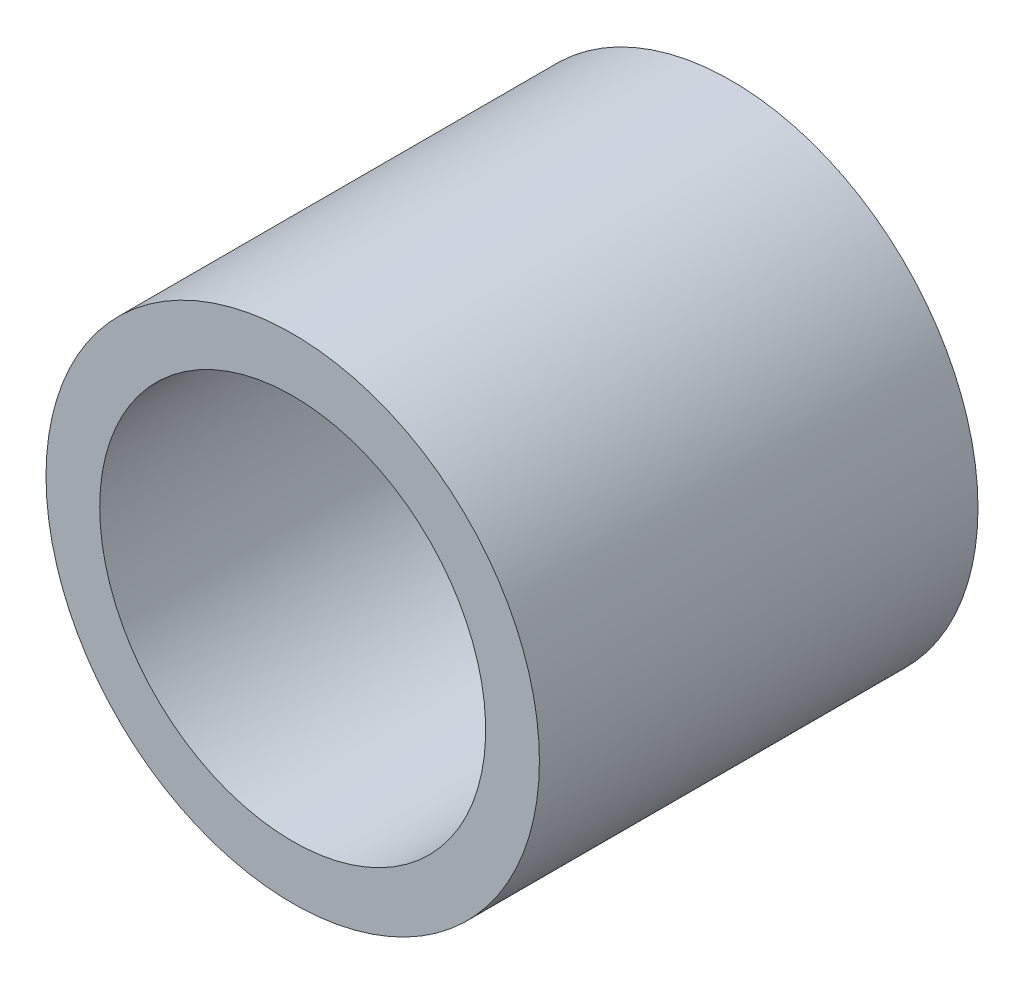
ISO-10303-21;
HEADER;
FILE_DESCRIPTION(('STEP AP214'),'2;1');
FILE_NAME('part.step','',(''),(''),'','','');
FILE_SCHEMA(('AUTOMOTIVE_DESIGN { 1 0 10303 214 1 1 1 1 }'));
ENDSEC;
DATA;
#1=APPLICATION_CONTEXT('core data for automotive mechanical design processes');
#2=APPLICATION_PROTOCOL_DEFINITION('international standard','automotive_design',2000,#1);
#3=PRODUCT_CONTEXT('',#1,'mechanical');
#4=PRODUCT('Part','Part','',(#3));
#5=PRODUCT_RELATED_PRODUCT_CATEGORY('part','',(#4));
#6=PRODUCT_DEFINITION_FORMATION('','',#4);
#7=PRODUCT_DEFINITION_CONTEXT('part definition',#1,'design');
#8=PRODUCT_DEFINITION('design','',#6,#7);
#9=PRODUCT_DEFINITION_SHAPE('','',#8);
#10=(LENGTH_UNIT() NAMED_UNIT(*) SI_UNIT(.MILLI.,.METRE.));
#11=(NAMED_UNIT(*) PLANE_ANGLE_UNIT() SI_UNIT($,.RADIAN.));
#12=(NAMED_UNIT(*) SI_UNIT($,.STERADIAN.) SOLID_ANGLE_UNIT());
#13=UNCERTAINTY_MEASURE_WITH_UNIT(LENGTH_MEASURE(1.E-05),#10,'distance_accuracy_value','');
#14=(GEOMETRIC_REPRESENTATION_CONTEXT(3) GLOBAL_UNCERTAINTY_ASSIGNED_CONTEXT((#13)) GLOBAL_UNIT_ASSIGNED_CONTEXT((#10,
#11,#12)) REPRESENTATION_CONTEXT('',''));
#15=CARTESIAN_POINT('',(0.,0.,0.));
#16=DIRECTION('',(0.,0.,1.));
#17=DIRECTION('',(1.,0.,0.));
#18=AXIS2_PLACEMENT_3D('',#15,#16,#17);
#19=CARTESIAN_POINT('',(0.,0.,12.7));
#20=DIRECTION('',(0.,0.,-1.));
#21=DIRECTION('',(-1.,0.,0.));
#22=AXIS2_PLACEMENT_3D('',#19,#20,#21);
#23=CYLINDRICAL_SURFACE('',#22,5.588);
#24=CARTESIAN_POINT('',(0.,0.,0.));
#25=DIRECTION('',(0.,0.,-1.));
#26=DIRECTION('',(-1.,0.,0.));
#27=AXIS2_PLACEMENT_3D('',#24,#25,#26);
#28=CIRCLE('',#27,5.588);
#29=CARTESIAN_POINT('',(-5.588,0.,0.));
#30=VERTEX_POINT('',#29);
#31=EDGE_CURVE('E27',#30,#30,#28,.T.);
#32=ORIENTED_EDGE('',*,*,#31,.T.);
#33=EDGE_LOOP('',(#32));
#34=FACE_BOUND('',#33,.T.);
#35=CARTESIAN_POINT('',(0.,0.,12.7));
#36=DIRECTION('',(0.,0.,-1.));
#37=DIRECTION('',(-1.,0.,0.));
#38=AXIS2_PLACEMENT_3D('',#35,#36,#37);
#39=CIRCLE('',#38,5.588);
#40=CARTESIAN_POINT('',(-5.588,0.,12.7));
#41=VERTEX_POINT('',#40);
#42=EDGE_CURVE('E18',#41,#41,#39,.T.);
#43=ORIENTED_EDGE('',*,*,#42,.F.);
#44=EDGE_LOOP('',(#43));
#45=FACE_BOUND('',#44,.T.);
#46=ADVANCED_FACE('F15',(#34,#45),#23,.F.);
#47=CARTESIAN_POINT('',(0.,0.,12.7));
#48=DIRECTION('',(0.,0.,1.));
#49=DIRECTION('',(1.,0.,0.));
#50=AXIS2_PLACEMENT_3D('',#47,#48,#49);
#51=PLANE('',#50);
#52=ORIENTED_EDGE('',*,*,#42,.T.);
#53=EDGE_LOOP('',(#52));
#54=FACE_BOUND('',#53,.T.);
#55=CARTESIAN_POINT('',(0.,0.,12.7));
#56=DIRECTION('',(0.,0.,-1.));
#57=DIRECTION('',(-1.,0.,0.));
#58=AXIS2_PLACEMENT_3D('',#55,#56,#57);
#59=CIRCLE('',#58,7.14375);
#60=CARTESIAN_POINT('',(-7.14375,0.,12.7));
#61=VERTEX_POINT('',#60);
#62=EDGE_CURVE('E22',#61,#61,#59,.T.);
#63=ORIENTED_EDGE('',*,*,#62,.F.);
#64=EDGE_LOOP('',(#63));
#65=FACE_BOUND('',#64,.T.);
#66=ADVANCED_FACE('F35',(#54,#65),#51,.T.);
#67=CARTESIAN_POINT('',(0.,0.,0.));
#68=DIRECTION('',(0.,0.,1.));
#69=DIRECTION('',(1.,0.,0.));
#70=AXIS2_PLACEMENT_3D('',#67,#68,#69);
#71=PLANE('',#70);
#72=ORIENTED_EDGE('',*,*,#31,.F.);
#73=EDGE_LOOP('',(#72));
#74=FACE_BOUND('',#73,.T.);
#75=CARTESIAN_POINT('',(0.,0.,0.));
#76=DIRECTION('',(0.,0.,-1.));
#77=DIRECTION('',(-1.,0.,0.));
#78=AXIS2_PLACEMENT_3D('',#75,#76,#77);
#79=CIRCLE('',#78,7.14375);
#80=CARTESIAN_POINT('',(-7.14375,0.,0.));
#81=VERTEX_POINT('',#80);
#82=EDGE_CURVE('E10',#81,#81,#79,.F.);
#83=ORIENTED_EDGE('',*,*,#82,.F.);
#84=EDGE_LOOP('',(#83));
#85=FACE_BOUND('',#84,.T.);
#86=ADVANCED_FACE('F43',(#74,#85),#71,.F.);
#87=CARTESIAN_POINT('',(0.,0.,12.7));
#88=DIRECTION('',(0.,0.,-1.));
#89=DIRECTION('',(-1.,0.,0.));
#90=AXIS2_PLACEMENT_3D('',#87,#88,#89);
#91=CYLINDRICAL_SURFACE('',#90,7.14375);
#92=ORIENTED_EDGE('',*,*,#82,.T.);
#93=EDGE_LOOP('',(#92));
#94=FACE_BOUND('',#93,.T.);
#95=ORIENTED_EDGE('',*,*,#62,.T.);
#96=EDGE_LOOP('',(#95));
#97=FACE_BOUND('',#96,.T.);
#98=ADVANCED_FACE('F44',(#94,#97),#91,.T.);
#99=CLOSED_SHELL('',(#46,#66,#86,#98));
#100=MANIFOLD_SOLID_BREP('B1',#99);
#101=ADVANCED_BREP_SHAPE_REPRESENTATION('',(#18,#100),#14);
#102=SHAPE_DEFINITION_REPRESENTATION(#9,#101);
ENDSEC;
END-ISO-10303-21;
